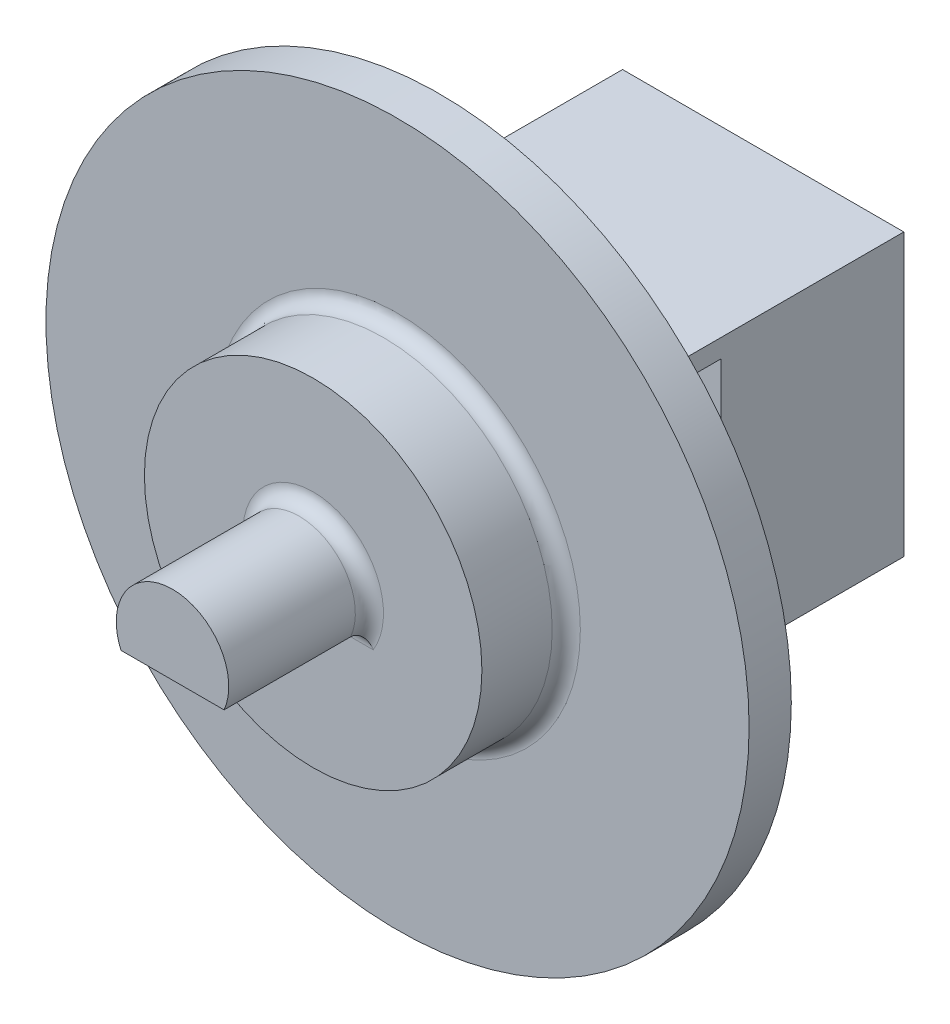
ISO-10303-21;
HEADER;
FILE_DESCRIPTION(('STEP AP214'),'2;1');
FILE_NAME('part.step','',(''),(''),'','','');
FILE_SCHEMA(('AUTOMOTIVE_DESIGN { 1 0 10303 214 1 1 1 1 }'));
ENDSEC;
DATA;
#1=APPLICATION_CONTEXT('core data for automotive mechanical design processes');
#2=APPLICATION_PROTOCOL_DEFINITION('international standard','automotive_design',2000,#1);
#3=PRODUCT_CONTEXT('',#1,'mechanical');
#4=PRODUCT('Part','Part','',(#3));
#5=PRODUCT_RELATED_PRODUCT_CATEGORY('part','',(#4));
#6=PRODUCT_DEFINITION_FORMATION('','',#4);
#7=PRODUCT_DEFINITION_CONTEXT('part definition',#1,'design');
#8=PRODUCT_DEFINITION('design','',#6,#7);
#9=PRODUCT_DEFINITION_SHAPE('','',#8);
#10=(LENGTH_UNIT() NAMED_UNIT(*) SI_UNIT(.MILLI.,.METRE.));
#11=(NAMED_UNIT(*) PLANE_ANGLE_UNIT() SI_UNIT($,.RADIAN.));
#12=(NAMED_UNIT(*) SI_UNIT($,.STERADIAN.) SOLID_ANGLE_UNIT());
#13=UNCERTAINTY_MEASURE_WITH_UNIT(LENGTH_MEASURE(1.E-05),#10,'distance_accuracy_value','');
#14=(GEOMETRIC_REPRESENTATION_CONTEXT(3) GLOBAL_UNCERTAINTY_ASSIGNED_CONTEXT((#13)) GLOBAL_UNIT_ASSIGNED_CONTEXT((#10,
#11,#12)) REPRESENTATION_CONTEXT('',''));
#15=CARTESIAN_POINT('',(0.,0.,0.));
#16=DIRECTION('',(0.,0.,1.));
#17=DIRECTION('',(1.,0.,0.));
#18=AXIS2_PLACEMENT_3D('',#15,#16,#17);
#19=CARTESIAN_POINT('',(5.,0.,11.5));
#20=DIRECTION('',(-1.,0.,0.));
#21=DIRECTION('',(0.,0.,1.));
#22=AXIS2_PLACEMENT_3D('',#19,#20,#21);
#23=PLANE('',#22);
#24=DIRECTION('',(0.,0.,-1.));
#25=VECTOR('',#24,1.);
#26=CARTESIAN_POINT('',(5.,-1.66255496103363,11.5));
#27=LINE('',#26,#25);
#28=CARTESIAN_POINT('',(5.,-1.66255496103363,11.5));
#29=VERTEX_POINT('',#28);
#30=CARTESIAN_POINT('',(5.,-1.66255496103363,6.5));
#31=VERTEX_POINT('',#30);
#32=EDGE_CURVE('E231',#29,#31,#27,.T.);
#33=ORIENTED_EDGE('',*,*,#32,.F.);
#34=DIRECTION('',(0.,1.,0.));
#35=VECTOR('',#34,1.);
#36=CARTESIAN_POINT('',(5.,0.,11.5));
#37=LINE('',#36,#35);
#38=CARTESIAN_POINT('',(5.,-5.,11.5));
#39=VERTEX_POINT('',#38);
#40=EDGE_CURVE('E283',#39,#29,#37,.T.);
#41=ORIENTED_EDGE('',*,*,#40,.F.);
#42=DIRECTION('',(0.,0.,-1.));
#43=VECTOR('',#42,1.);
#44=CARTESIAN_POINT('',(5.,-5.,11.5));
#45=LINE('',#44,#43);
#46=CARTESIAN_POINT('',(5.,-5.,0.));
#47=VERTEX_POINT('',#46);
#48=EDGE_CURVE('E311',#39,#47,#45,.T.);
#49=ORIENTED_EDGE('',*,*,#48,.T.);
#50=DIRECTION('',(0.,1.,0.));
#51=VECTOR('',#50,1.);
#52=CARTESIAN_POINT('',(5.,0.,0.));
#53=LINE('',#52,#51);
#54=CARTESIAN_POINT('',(5.,5.,0.));
#55=VERTEX_POINT('',#54);
#56=EDGE_CURVE('E295',#47,#55,#53,.T.);
#57=ORIENTED_EDGE('',*,*,#56,.T.);
#58=DIRECTION('',(0.,0.,-1.));
#59=VECTOR('',#58,1.);
#60=CARTESIAN_POINT('',(5.,5.,11.5));
#61=LINE('',#60,#59);
#62=CARTESIAN_POINT('',(5.,5.,11.5));
#63=VERTEX_POINT('',#62);
#64=EDGE_CURVE('E309',#63,#55,#61,.T.);
#65=ORIENTED_EDGE('',*,*,#64,.F.);
#66=CARTESIAN_POINT('',(5.,4.34204688534485,11.5));
#67=VERTEX_POINT('',#66);
#68=EDGE_CURVE('E281',#67,#63,#37,.T.);
#69=ORIENTED_EDGE('',*,*,#68,.F.);
#70=DIRECTION('',(0.,0.,1.));
#71=VECTOR('',#70,1.);
#72=CARTESIAN_POINT('',(5.,4.34204688534485,11.5));
#73=LINE('',#72,#71);
#74=CARTESIAN_POINT('',(5.,4.34204688534485,6.5));
#75=VERTEX_POINT('',#74);
#76=EDGE_CURVE('E229',#75,#67,#73,.T.);
#77=ORIENTED_EDGE('',*,*,#76,.F.);
#78=DIRECTION('',(0.,1.,0.));
#79=VECTOR('',#78,1.);
#80=CARTESIAN_POINT('',(5.,0.,6.5));
#81=LINE('',#80,#79);
#82=EDGE_CURVE('E234',#31,#75,#81,.T.);
#83=ORIENTED_EDGE('',*,*,#82,.F.);
#84=EDGE_LOOP('',(#33,#41,#49,#57,#65,#69,#77,#83));
#85=FACE_BOUND('',#84,.T.);
#86=ADVANCED_FACE('F62',(#85),#23,.F.);
#87=CARTESIAN_POINT('',(2.05060966544099,2.05060966544099,6.5));
#88=DIRECTION('',(-0.707106781186548,-0.707106781186548,0.));
#89=DIRECTION('',(0.707106781186548,-0.707106781186548,0.));
#90=AXIS2_PLACEMENT_3D('',#87,#88,#89);
#91=PLANE('',#90);
#92=DIRECTION('',(-0.707106781186547,0.707106781186548,0.));
#93=VECTOR('',#92,1.);
#94=CARTESIAN_POINT('',(3.23452970778619,0.866689623095786,13.));
#95=LINE('',#94,#93);
#96=CARTESIAN_POINT('',(3.23452970778619,0.866689623095786,13.));
#97=VERTEX_POINT('',#96);
#98=CARTESIAN_POINT('',(1.27493791355965,2.82628141732233,13.));
#99=VERTEX_POINT('',#98);
#100=EDGE_CURVE('E239',#97,#99,#95,.T.);
#101=ORIENTED_EDGE('',*,*,#100,.T.);
#102=CARTESIAN_POINT('',(1.27493791355965,2.82628141732233,12.5));
#103=DIRECTION('',(-0.707106781186548,-0.707106781186548,0.));
#104=DIRECTION('',(-0.707106781186548,0.707106781186548,0.));
#105=AXIS2_PLACEMENT_3D('',#102,#103,#104);
#106=ELLIPSE('',#105,0.577350269189626,0.5);
#107=CARTESIAN_POINT('',(0.866689623095786,3.23452970778619,12.5));
#108=VERTEX_POINT('',#107);
#109=EDGE_CURVE('E333',#99,#108,#106,.T.);
#110=ORIENTED_EDGE('',*,*,#109,.T.);
#111=DIRECTION('',(0.,0.,1.));
#112=VECTOR('',#111,1.);
#113=CARTESIAN_POINT('',(0.866689623095786,3.23452970778619,6.5));
#114=LINE('',#113,#112);
#115=CARTESIAN_POINT('',(0.866689623095788,3.23452970778619,11.5));
#116=VERTEX_POINT('',#115);
#117=EDGE_CURVE('E272',#116,#108,#114,.T.);
#118=ORIENTED_EDGE('',*,*,#117,.F.);
#119=DIRECTION('',(0.707106781186548,-0.707106781186548,0.));
#120=VECTOR('',#119,1.);
#121=CARTESIAN_POINT('',(2.05060966544099,2.05060966544099,11.5));
#122=LINE('',#121,#120);
#123=CARTESIAN_POINT('',(3.23452970778619,0.866689623095786,11.5));
#124=VERTEX_POINT('',#123);
#125=EDGE_CURVE('E226',#116,#124,#122,.T.);
#126=ORIENTED_EDGE('',*,*,#125,.T.);
#127=DIRECTION('',(0.,0.,1.));
#128=VECTOR('',#127,1.);
#129=CARTESIAN_POINT('',(3.23452970778619,0.866689623095786,6.5));
#130=LINE('',#129,#128);
#131=EDGE_CURVE('E269',#124,#97,#130,.T.);
#132=ORIENTED_EDGE('',*,*,#131,.T.);
#133=EDGE_LOOP('',(#101,#110,#118,#126,#132));
#134=FACE_BOUND('',#133,.T.);
#135=ADVANCED_FACE('F388',(#134),#91,.T.);
#136=CARTESIAN_POINT('',(2.8011848962383,-0.75057523079731,6.5));
#137=DIRECTION('',(-0.965925826289068,0.258819045102521,0.));
#138=DIRECTION('',(-0.258819045102521,-0.965925826289068,0.));
#139=AXIS2_PLACEMENT_3D('',#136,#137,#138);
#140=PLANE('',#139);
#141=DIRECTION('',(0.,0.,1.));
#142=VECTOR('',#141,1.);
#143=CARTESIAN_POINT('',(2.36784008469041,-2.3678400846904,6.5));
#144=LINE('',#143,#142);
#145=CARTESIAN_POINT('',(2.36784008469041,-2.36784008469041,11.5));
#146=VERTEX_POINT('',#145);
#147=CARTESIAN_POINT('',(2.36784008469041,-2.3678400846904,12.5));
#148=VERTEX_POINT('',#147);
#149=EDGE_CURVE('E266',#146,#148,#144,.T.);
#150=ORIENTED_EDGE('',*,*,#149,.T.);
#151=CARTESIAN_POINT('',(2.51726933005175,-1.8101625488652,12.5));
#152=DIRECTION('',(-0.965925826289068,0.258819045102521,0.));
#153=DIRECTION('',(0.258819045102521,0.965925826289068,0.));
#154=AXIS2_PLACEMENT_3D('',#151,#152,#153);
#155=ELLIPSE('',#154,0.577350269189626,0.5);
#156=CARTESIAN_POINT('',(2.51726933005175,-1.8101625488652,13.));
#157=VERTEX_POINT('',#156);
#158=EDGE_CURVE('E317',#148,#157,#155,.T.);
#159=ORIENTED_EDGE('',*,*,#158,.T.);
#160=DIRECTION('',(0.258819045102521,0.965925826289068,0.));
#161=VECTOR('',#160,1.);
#162=CARTESIAN_POINT('',(2.3678400846904,-2.36784008469041,13.));
#163=LINE('',#162,#161);
#164=EDGE_CURVE('E237',#157,#97,#163,.T.);
#165=ORIENTED_EDGE('',*,*,#164,.T.);
#166=ORIENTED_EDGE('',*,*,#131,.F.);
#167=DIRECTION('',(-0.258819045102521,-0.965925826289068,0.));
#168=VECTOR('',#167,1.);
#169=CARTESIAN_POINT('',(2.8011848962383,-0.75057523079731,11.5));
#170=LINE('',#169,#168);
#171=EDGE_CURVE('E223',#124,#146,#170,.T.);
#172=ORIENTED_EDGE('',*,*,#171,.T.);
#173=EDGE_LOOP('',(#150,#159,#165,#166,#172));
#174=FACE_BOUND('',#173,.T.);
#175=ADVANCED_FACE('F384',(#174),#140,.T.);
#176=CARTESIAN_POINT('',(0.,-5.,11.5));
#177=DIRECTION('',(0.,1.,0.));
#178=DIRECTION('',(0.,0.,1.));
#179=AXIS2_PLACEMENT_3D('',#176,#177,#178);
#180=PLANE('',#179);
#181=DIRECTION('',(1.,0.,0.));
#182=VECTOR('',#181,1.);
#183=CARTESIAN_POINT('',(0.,-5.,0.));
#184=LINE('',#183,#182);
#185=CARTESIAN_POINT('',(-5.,-5.,0.));
#186=VERTEX_POINT('',#185);
#187=EDGE_CURVE('E278',#186,#47,#184,.T.);
#188=ORIENTED_EDGE('',*,*,#187,.T.);
#189=ORIENTED_EDGE('',*,*,#48,.F.);
#190=DIRECTION('',(1.,0.,0.));
#191=VECTOR('',#190,1.);
#192=CARTESIAN_POINT('',(0.,-5.,11.5));
#193=LINE('',#192,#191);
#194=CARTESIAN_POINT('',(-5.,-5.,11.5));
#195=VERTEX_POINT('',#194);
#196=EDGE_CURVE('E279',#195,#39,#193,.T.);
#197=ORIENTED_EDGE('',*,*,#196,.F.);
#198=DIRECTION('',(0.,0.,-1.));
#199=VECTOR('',#198,1.);
#200=CARTESIAN_POINT('',(-5.,-5.,11.5));
#201=LINE('',#200,#199);
#202=EDGE_CURVE('E292',#195,#186,#201,.T.);
#203=ORIENTED_EDGE('',*,*,#202,.T.);
#204=EDGE_LOOP('',(#188,#189,#197,#203));
#205=FACE_BOUND('',#204,.T.);
#206=ADVANCED_FACE('F380',(#205),#180,.F.);
#207=CARTESIAN_POINT('',(0.,5.,11.5));
#208=DIRECTION('',(0.,1.,0.));
#209=DIRECTION('',(0.,0.,1.));
#210=AXIS2_PLACEMENT_3D('',#207,#208,#209);
#211=PLANE('',#210);
#212=DIRECTION('',(1.,0.,0.));
#213=VECTOR('',#212,1.);
#214=CARTESIAN_POINT('',(0.,5.,0.));
#215=LINE('',#214,#213);
#216=CARTESIAN_POINT('',(-5.,5.,0.));
#217=VERTEX_POINT('',#216);
#218=EDGE_CURVE('E298',#217,#55,#215,.T.);
#219=ORIENTED_EDGE('',*,*,#218,.F.);
#220=DIRECTION('',(0.,0.,-1.));
#221=VECTOR('',#220,1.);
#222=CARTESIAN_POINT('',(-5.,5.,11.5));
#223=LINE('',#222,#221);
#224=CARTESIAN_POINT('',(-5.,5.,11.5));
#225=VERTEX_POINT('',#224);
#226=EDGE_CURVE('E307',#225,#217,#223,.T.);
#227=ORIENTED_EDGE('',*,*,#226,.F.);
#228=DIRECTION('',(1.,0.,0.));
#229=VECTOR('',#228,1.);
#230=CARTESIAN_POINT('',(0.,5.,11.5));
#231=LINE('',#230,#229);
#232=EDGE_CURVE('E286',#225,#63,#231,.T.);
#233=ORIENTED_EDGE('',*,*,#232,.T.);
#234=ORIENTED_EDGE('',*,*,#64,.T.);
#235=EDGE_LOOP('',(#219,#227,#233,#234));
#236=FACE_BOUND('',#235,.T.);
#237=ADVANCED_FACE('F383',(#236),#211,.T.);
#238=CARTESIAN_POINT('',(-5.,0.,11.5));
#239=DIRECTION('',(-1.,0.,0.));
#240=DIRECTION('',(0.,0.,1.));
#241=AXIS2_PLACEMENT_3D('',#238,#239,#240);
#242=PLANE('',#241);
#243=DIRECTION('',(0.,1.,0.));
#244=VECTOR('',#243,1.);
#245=CARTESIAN_POINT('',(-5.,0.,0.));
#246=LINE('',#245,#244);
#247=EDGE_CURVE('E301',#186,#217,#246,.T.);
#248=ORIENTED_EDGE('',*,*,#247,.F.);
#249=ORIENTED_EDGE('',*,*,#202,.F.);
#250=DIRECTION('',(0.,1.,0.));
#251=VECTOR('',#250,1.);
#252=CARTESIAN_POINT('',(-5.,0.,11.5));
#253=LINE('',#252,#251);
#254=EDGE_CURVE('E289',#195,#225,#253,.T.);
#255=ORIENTED_EDGE('',*,*,#254,.T.);
#256=ORIENTED_EDGE('',*,*,#226,.T.);
#257=EDGE_LOOP('',(#248,#249,#255,#256));
#258=FACE_BOUND('',#257,.T.);
#259=ADVANCED_FACE('F392',(#258),#242,.T.);
#260=CARTESIAN_POINT('',(0.,0.,11.5));
#261=DIRECTION('',(0.,0.,-1.));
#262=DIRECTION('',(-1.,0.,0.));
#263=AXIS2_PLACEMENT_3D('',#260,#261,#262);
#264=CYLINDRICAL_SURFACE('',#263,1.75);
#265=CARTESIAN_POINT('',(0.,0.,6.5));
#266=DIRECTION('',(0.,0.,1.));
#267=DIRECTION('',(1.,0.,0.));
#268=AXIS2_PLACEMENT_3D('',#265,#266,#267);
#269=CIRCLE('',#268,1.75);
#270=CARTESIAN_POINT('',(1.75,0.,6.5));
#271=VERTEX_POINT('',#270);
#272=EDGE_CURVE('E246',#271,#271,#269,.T.);
#273=ORIENTED_EDGE('',*,*,#272,.T.);
#274=EDGE_LOOP('',(#273));
#275=FACE_BOUND('',#274,.T.);
#276=CARTESIAN_POINT('',(0.,0.,0.));
#277=DIRECTION('',(0.,0.,1.));
#278=DIRECTION('',(1.,0.,0.));
#279=AXIS2_PLACEMENT_3D('',#276,#277,#278);
#280=CIRCLE('',#279,1.75);
#281=CARTESIAN_POINT('',(1.75,0.,0.));
#282=VERTEX_POINT('',#281);
#283=EDGE_CURVE('E282',#282,#282,#280,.T.);
#284=ORIENTED_EDGE('',*,*,#283,.F.);
#285=EDGE_LOOP('',(#284));
#286=FACE_BOUND('',#285,.T.);
#287=ADVANCED_FACE('F396',(#275,#286),#264,.F.);
#288=CARTESIAN_POINT('',(0.,0.,0.));
#289=DIRECTION('',(0.,0.,1.));
#290=DIRECTION('',(1.,0.,0.));
#291=AXIS2_PLACEMENT_3D('',#288,#289,#290);
#292=PLANE('',#291);
#293=ORIENTED_EDGE('',*,*,#187,.F.);
#294=ORIENTED_EDGE('',*,*,#247,.T.);
#295=ORIENTED_EDGE('',*,*,#218,.T.);
#296=ORIENTED_EDGE('',*,*,#56,.F.);
#297=EDGE_LOOP('',(#293,#294,#295,#296));
#298=FACE_BOUND('',#297,.T.);
#299=ORIENTED_EDGE('',*,*,#283,.T.);
#300=EDGE_LOOP('',(#299));
#301=FACE_BOUND('',#300,.T.);
#302=ADVANCED_FACE('F400',(#298,#301),#292,.F.);
#303=CARTESIAN_POINT('',(-2.8011848962383,0.750575230797311,6.5));
#304=DIRECTION('',(0.965925826289068,-0.258819045102521,0.));
#305=DIRECTION('',(0.258819045102521,0.965925826289068,0.));
#306=AXIS2_PLACEMENT_3D('',#303,#304,#305);
#307=PLANE('',#306);
#308=DIRECTION('',(0.,0.,1.));
#309=VECTOR('',#308,1.);
#310=CARTESIAN_POINT('',(-2.3678400846904,2.36784008469041,6.5));
#311=LINE('',#310,#309);
#312=CARTESIAN_POINT('',(-2.3678400846904,2.36784008469041,6.5));
#313=VERTEX_POINT('',#312);
#314=CARTESIAN_POINT('',(-2.3678400846904,2.36784008469041,12.5));
#315=VERTEX_POINT('',#314);
#316=EDGE_CURVE('E275',#313,#315,#311,.T.);
#317=ORIENTED_EDGE('',*,*,#316,.T.);
#318=DIRECTION('',(-0.258819045102521,-0.965925826289068,0.));
#319=VECTOR('',#318,1.);
#320=CARTESIAN_POINT('',(-2.8011848962383,0.750575230797311,12.5));
#321=LINE('',#320,#319);
#322=CARTESIAN_POINT('',(-3.23452970778619,-0.866689623095785,12.5));
#323=VERTEX_POINT('',#322);
#324=EDGE_CURVE('E329',#315,#323,#321,.T.);
#325=ORIENTED_EDGE('',*,*,#324,.T.);
#326=DIRECTION('',(0.,0.,1.));
#327=VECTOR('',#326,1.);
#328=CARTESIAN_POINT('',(-3.23452970778619,-0.866689623095785,6.5));
#329=LINE('',#328,#327);
#330=CARTESIAN_POINT('',(-3.23452970778619,-0.866689623095785,6.5));
#331=VERTEX_POINT('',#330);
#332=EDGE_CURVE('E260',#331,#323,#329,.T.);
#333=ORIENTED_EDGE('',*,*,#332,.F.);
#334=DIRECTION('',(0.258819045102521,0.965925826289068,0.));
#335=VECTOR('',#334,1.);
#336=CARTESIAN_POINT('',(-2.8011848962383,0.750575230797311,6.5));
#337=LINE('',#336,#335);
#338=EDGE_CURVE('E251',#331,#313,#337,.T.);
#339=ORIENTED_EDGE('',*,*,#338,.T.);
#340=EDGE_LOOP('',(#317,#325,#333,#339));
#341=FACE_BOUND('',#340,.T.);
#342=ADVANCED_FACE('F404',(#341),#307,.T.);
#343=CARTESIAN_POINT('',(-0.75057523079731,2.8011848962383,6.5));
#344=DIRECTION('',(0.258819045102521,-0.965925826289068,0.));
#345=DIRECTION('',(0.965925826289068,0.258819045102521,0.));
#346=AXIS2_PLACEMENT_3D('',#343,#344,#345);
#347=PLANE('',#346);
#348=ORIENTED_EDGE('',*,*,#117,.T.);
#349=DIRECTION('',(-0.965925826289068,-0.258819045102521,0.));
#350=VECTOR('',#349,1.);
#351=CARTESIAN_POINT('',(-0.75057523079731,2.8011848962383,12.5));
#352=LINE('',#351,#350);
#353=EDGE_CURVE('E331',#108,#315,#352,.T.);
#354=ORIENTED_EDGE('',*,*,#353,.T.);
#355=ORIENTED_EDGE('',*,*,#316,.F.);
#356=DIRECTION('',(0.965925826289068,0.258819045102521,0.));
#357=VECTOR('',#356,1.);
#358=CARTESIAN_POINT('',(-0.75057523079731,2.8011848962383,6.5));
#359=LINE('',#358,#357);
#360=EDGE_CURVE('E254',#313,#75,#359,.T.);
#361=ORIENTED_EDGE('',*,*,#360,.T.);
#362=ORIENTED_EDGE('',*,*,#76,.T.);
#363=DIRECTION('',(-0.965925826289069,-0.25881904510252,0.));
#364=VECTOR('',#363,1.);
#365=CARTESIAN_POINT('',(14.0370835428554,6.76352612258555,11.5));
#366=LINE('',#365,#364);
#367=EDGE_CURVE('E217',#67,#116,#366,.T.);
#368=ORIENTED_EDGE('',*,*,#367,.T.);
#369=EDGE_LOOP('',(#348,#354,#355,#361,#362,#368));
#370=FACE_BOUND('',#369,.T.);
#371=ADVANCED_FACE('F408',(#370),#347,.T.);
#372=CARTESIAN_POINT('',(0.75057523079731,-2.8011848962383,6.5));
#373=DIRECTION('',(-0.258819045102521,0.965925826289068,0.));
#374=DIRECTION('',(-0.965925826289068,-0.258819045102521,0.));
#375=AXIS2_PLACEMENT_3D('',#372,#373,#374);
#376=PLANE('',#375);
#377=DIRECTION('',(0.,0.,1.));
#378=VECTOR('',#377,1.);
#379=CARTESIAN_POINT('',(-0.866689623095786,-3.23452970778619,6.5));
#380=LINE('',#379,#378);
#381=CARTESIAN_POINT('',(-0.866689623095786,-3.23452970778619,6.5));
#382=VERTEX_POINT('',#381);
#383=CARTESIAN_POINT('',(-0.866689623095786,-3.23452970778619,12.5));
#384=VERTEX_POINT('',#383);
#385=EDGE_CURVE('E263',#382,#384,#380,.T.);
#386=ORIENTED_EDGE('',*,*,#385,.T.);
#387=DIRECTION('',(0.965925826289068,0.258819045102521,0.));
#388=VECTOR('',#387,1.);
#389=CARTESIAN_POINT('',(0.75057523079731,-2.8011848962383,12.5));
#390=LINE('',#389,#388);
#391=EDGE_CURVE('E314',#384,#148,#390,.T.);
#392=ORIENTED_EDGE('',*,*,#391,.T.);
#393=ORIENTED_EDGE('',*,*,#149,.F.);
#394=DIRECTION('',(-0.965925826289069,-0.25881904510252,0.));
#395=VECTOR('',#394,1.);
#396=CARTESIAN_POINT('',(15.5382340044501,1.16115633010895,11.5));
#397=LINE('',#396,#395);
#398=EDGE_CURVE('E221',#29,#146,#397,.T.);
#399=ORIENTED_EDGE('',*,*,#398,.F.);
#400=ORIENTED_EDGE('',*,*,#32,.T.);
#401=DIRECTION('',(-0.965925826289068,-0.258819045102521,0.));
#402=VECTOR('',#401,1.);
#403=CARTESIAN_POINT('',(0.75057523079731,-2.8011848962383,6.5));
#404=LINE('',#403,#402);
#405=EDGE_CURVE('E256',#31,#382,#404,.T.);
#406=ORIENTED_EDGE('',*,*,#405,.T.);
#407=EDGE_LOOP('',(#386,#392,#393,#399,#400,#406));
#408=FACE_BOUND('',#407,.T.);
#409=ADVANCED_FACE('F412',(#408),#376,.T.);
#410=CARTESIAN_POINT('',(-2.05060966544099,-2.05060966544099,6.5));
#411=DIRECTION('',(0.707106781186548,0.707106781186548,0.));
#412=DIRECTION('',(-0.707106781186548,0.707106781186548,0.));
#413=AXIS2_PLACEMENT_3D('',#410,#411,#412);
#414=PLANE('',#413);
#415=ORIENTED_EDGE('',*,*,#332,.T.);
#416=DIRECTION('',(0.707106781186548,-0.707106781186548,0.));
#417=VECTOR('',#416,1.);
#418=CARTESIAN_POINT('',(-2.05060966544099,-2.05060966544099,12.5));
#419=LINE('',#418,#417);
#420=EDGE_CURVE('E327',#323,#384,#419,.T.);
#421=ORIENTED_EDGE('',*,*,#420,.T.);
#422=ORIENTED_EDGE('',*,*,#385,.F.);
#423=DIRECTION('',(-0.707106781186548,0.707106781186548,0.));
#424=VECTOR('',#423,1.);
#425=CARTESIAN_POINT('',(-2.05060966544099,-2.05060966544099,6.5));
#426=LINE('',#425,#424);
#427=EDGE_CURVE('E258',#382,#331,#426,.T.);
#428=ORIENTED_EDGE('',*,*,#427,.T.);
#429=EDGE_LOOP('',(#415,#421,#422,#428));
#430=FACE_BOUND('',#429,.T.);
#431=ADVANCED_FACE('F422',(#430),#414,.T.);
#432=CARTESIAN_POINT('',(0.,0.,6.5));
#433=DIRECTION('',(0.,0.,-1.));
#434=DIRECTION('',(-1.,0.,0.));
#435=AXIS2_PLACEMENT_3D('',#432,#433,#434);
#436=PLANE('',#435);
#437=ORIENTED_EDGE('',*,*,#272,.F.);
#438=EDGE_LOOP('',(#437));
#439=FACE_BOUND('',#438,.T.);
#440=ORIENTED_EDGE('',*,*,#405,.F.);
#441=ORIENTED_EDGE('',*,*,#82,.T.);
#442=ORIENTED_EDGE('',*,*,#360,.F.);
#443=ORIENTED_EDGE('',*,*,#338,.F.);
#444=ORIENTED_EDGE('',*,*,#427,.F.);
#445=EDGE_LOOP('',(#440,#441,#442,#443,#444));
#446=FACE_BOUND('',#445,.T.);
#447=ADVANCED_FACE('F426',(#439,#446),#436,.F.);
#448=CARTESIAN_POINT('',(0.,0.,11.5));
#449=DIRECTION('',(0.,0.,1.));
#450=DIRECTION('',(1.,0.,0.));
#451=AXIS2_PLACEMENT_3D('',#448,#449,#450);
#452=PLANE('',#451);
#453=ORIENTED_EDGE('',*,*,#40,.T.);
#454=ORIENTED_EDGE('',*,*,#398,.T.);
#455=ORIENTED_EDGE('',*,*,#171,.F.);
#456=ORIENTED_EDGE('',*,*,#125,.F.);
#457=ORIENTED_EDGE('',*,*,#367,.F.);
#458=ORIENTED_EDGE('',*,*,#68,.T.);
#459=ORIENTED_EDGE('',*,*,#232,.F.);
#460=ORIENTED_EDGE('',*,*,#254,.F.);
#461=ORIENTED_EDGE('',*,*,#196,.T.);
#462=EDGE_LOOP('',(#453,#454,#455,#456,#457,#458,#459,#460,#461));
#463=FACE_BOUND('',#462,.T.);
#464=CARTESIAN_POINT('',(0.,0.,11.5));
#465=DIRECTION('',(0.,0.,1.));
#466=DIRECTION('',(1.,0.,0.));
#467=AXIS2_PLACEMENT_3D('',#464,#465,#466);
#468=CIRCLE('',#467,12.5);
#469=CARTESIAN_POINT('',(12.5,0.,11.5));
#470=VERTEX_POINT('',#469);
#471=EDGE_CURVE('E242',#470,#470,#468,.T.);
#472=ORIENTED_EDGE('',*,*,#471,.F.);
#473=EDGE_LOOP('',(#472));
#474=FACE_BOUND('',#473,.T.);
#475=ADVANCED_FACE('F430',(#463,#474),#452,.F.);
#476=CARTESIAN_POINT('',(0.,0.,13.));
#477=DIRECTION('',(0.,0.,1.));
#478=DIRECTION('',(1.,0.,0.));
#479=AXIS2_PLACEMENT_3D('',#476,#477,#478);
#480=PLANE('',#479);
#481=CARTESIAN_POINT('',(0.,0.,13.));
#482=DIRECTION('',(0.,0.,1.));
#483=DIRECTION('',(1.,0.,0.));
#484=AXIS2_PLACEMENT_3D('',#481,#482,#483);
#485=CIRCLE('',#484,6.5);
#486=CARTESIAN_POINT('',(6.5,0.,13.));
#487=VERTEX_POINT('',#486);
#488=EDGE_CURVE('E342',#487,#487,#485,.F.);
#489=ORIENTED_EDGE('',*,*,#488,.T.);
#490=EDGE_LOOP('',(#489));
#491=FACE_BOUND('',#490,.T.);
#492=CARTESIAN_POINT('',(0.,0.,13.));
#493=DIRECTION('',(0.,0.,1.));
#494=DIRECTION('',(1.,0.,0.));
#495=AXIS2_PLACEMENT_3D('',#492,#493,#494);
#496=CIRCLE('',#495,12.5);
#497=CARTESIAN_POINT('',(12.5,0.,13.));
#498=VERTEX_POINT('',#497);
#499=EDGE_CURVE('E243',#498,#498,#496,.T.);
#500=ORIENTED_EDGE('',*,*,#499,.T.);
#501=EDGE_LOOP('',(#500));
#502=FACE_BOUND('',#501,.T.);
#503=ADVANCED_FACE('F436',(#491,#502),#480,.T.);
#504=CARTESIAN_POINT('',(0.,0.,13.));
#505=DIRECTION('',(0.,0.,-1.));
#506=DIRECTION('',(-1.,0.,0.));
#507=AXIS2_PLACEMENT_3D('',#504,#505,#506);
#508=CYLINDRICAL_SURFACE('',#507,12.5);
#509=ORIENTED_EDGE('',*,*,#499,.F.);
#510=EDGE_LOOP('',(#509));
#511=FACE_BOUND('',#510,.T.);
#512=ORIENTED_EDGE('',*,*,#471,.T.);
#513=EDGE_LOOP('',(#512));
#514=FACE_BOUND('',#513,.T.);
#515=ADVANCED_FACE('F432',(#511,#514),#508,.T.);
#516=CARTESIAN_POINT('',(0.,0.,16.));
#517=DIRECTION('',(0.,0.,1.));
#518=DIRECTION('',(1.,0.,0.));
#519=AXIS2_PLACEMENT_3D('',#516,#517,#518);
#520=PLANE('',#519);
#521=CARTESIAN_POINT('',(0.,0.,16.));
#522=DIRECTION('',(0.,0.,1.));
#523=DIRECTION('',(1.,0.,0.));
#524=AXIS2_PLACEMENT_3D('',#521,#522,#523);
#525=CIRCLE('',#524,2.5);
#526=CARTESIAN_POINT('',(-2.13541565040626,-1.3,16.));
#527=VERTEX_POINT('',#526);
#528=CARTESIAN_POINT('',(2.13541565040626,-1.3,16.));
#529=VERTEX_POINT('',#528);
#530=EDGE_CURVE('E83',#527,#529,#525,.F.);
#531=ORIENTED_EDGE('',*,*,#530,.T.);
#532=DIRECTION('',(1.,0.,0.));
#533=VECTOR('',#532,1.);
#534=CARTESIAN_POINT('',(0.,-1.3,16.));
#535=LINE('',#534,#533);
#536=EDGE_CURVE('E76',#529,#527,#535,.F.);
#537=ORIENTED_EDGE('',*,*,#536,.T.);
#538=EDGE_LOOP('',(#531,#537));
#539=FACE_BOUND('',#538,.T.);
#540=CARTESIAN_POINT('',(0.,0.,16.));
#541=DIRECTION('',(0.,0.,1.));
#542=DIRECTION('',(1.,0.,0.));
#543=AXIS2_PLACEMENT_3D('',#540,#541,#542);
#544=CIRCLE('',#543,6.);
#545=CARTESIAN_POINT('',(6.,0.,16.));
#546=VERTEX_POINT('',#545);
#547=EDGE_CURVE('E214',#546,#546,#544,.T.);
#548=ORIENTED_EDGE('',*,*,#547,.T.);
#549=EDGE_LOOP('',(#548));
#550=FACE_BOUND('',#549,.T.);
#551=ADVANCED_FACE('F435',(#539,#550),#520,.T.);
#552=CARTESIAN_POINT('',(0.,0.,16.));
#553=DIRECTION('',(0.,0.,-1.));
#554=DIRECTION('',(-1.,0.,0.));
#555=AXIS2_PLACEMENT_3D('',#552,#553,#554);
#556=CYLINDRICAL_SURFACE('',#555,6.);
#557=CARTESIAN_POINT('',(0.,0.,13.5));
#558=DIRECTION('',(0.,0.,1.));
#559=DIRECTION('',(1.,0.,0.));
#560=AXIS2_PLACEMENT_3D('',#557,#558,#559);
#561=CIRCLE('',#560,6.);
#562=CARTESIAN_POINT('',(6.,0.,13.5));
#563=VERTEX_POINT('',#562);
#564=EDGE_CURVE('E334',#563,#563,#561,.T.);
#565=ORIENTED_EDGE('',*,*,#564,.T.);
#566=EDGE_LOOP('',(#565));
#567=FACE_BOUND('',#566,.T.);
#568=ORIENTED_EDGE('',*,*,#547,.F.);
#569=EDGE_LOOP('',(#568));
#570=FACE_BOUND('',#569,.T.);
#571=ADVANCED_FACE('F444',(#567,#570),#556,.T.);
#572=CARTESIAN_POINT('',(0.,0.,13.));
#573=DIRECTION('',(0.,0.,1.));
#574=DIRECTION('',(1.,0.,0.));
#575=AXIS2_PLACEMENT_3D('',#572,#573,#574);
#576=PLANE('',#575);
#577=ORIENTED_EDGE('',*,*,#164,.F.);
#578=DIRECTION('',(0.965925826289068,0.258819045102521,0.));
#579=VECTOR('',#578,1.);
#580=CARTESIAN_POINT('',(0.621165708246049,-2.31822198309376,13.));
#581=LINE('',#580,#579);
#582=CARTESIAN_POINT('',(-0.717260377734444,-2.67685217196098,13.));
#583=VERTEX_POINT('',#582);
#584=EDGE_CURVE('E325',#157,#583,#581,.F.);
#585=ORIENTED_EDGE('',*,*,#584,.T.);
#586=DIRECTION('',(0.707106781186548,-0.707106781186548,0.));
#587=VECTOR('',#586,1.);
#588=CARTESIAN_POINT('',(-1.69705627484771,-1.69705627484771,13.));
#589=LINE('',#588,#587);
#590=CARTESIAN_POINT('',(-2.67685217196098,-0.717260377734443,13.));
#591=VERTEX_POINT('',#590);
#592=EDGE_CURVE('E323',#583,#591,#589,.F.);
#593=ORIENTED_EDGE('',*,*,#592,.T.);
#594=DIRECTION('',(-0.258819045102521,-0.965925826289068,0.));
#595=VECTOR('',#594,1.);
#596=CARTESIAN_POINT('',(-2.31822198309376,0.621165708246051,13.));
#597=LINE('',#596,#595);
#598=CARTESIAN_POINT('',(-1.95959179422654,1.95959179422654,13.));
#599=VERTEX_POINT('',#598);
#600=EDGE_CURVE('E321',#591,#599,#597,.F.);
#601=ORIENTED_EDGE('',*,*,#600,.T.);
#602=DIRECTION('',(-0.965925826289068,-0.258819045102521,0.));
#603=VECTOR('',#602,1.);
#604=CARTESIAN_POINT('',(-0.621165708246051,2.31822198309376,13.));
#605=LINE('',#604,#603);
#606=EDGE_CURVE('E319',#599,#99,#605,.F.);
#607=ORIENTED_EDGE('',*,*,#606,.T.);
#608=ORIENTED_EDGE('',*,*,#100,.F.);
#609=EDGE_LOOP('',(#577,#585,#593,#601,#607,#608));
#610=FACE_BOUND('',#609,.T.);
#611=ADVANCED_FACE('F368',(#610),#576,.F.);
#612=CARTESIAN_POINT('',(-0.62116570824605,2.31822198309376,12.5));
#613=DIRECTION('',(-0.965925826289068,-0.258819045102521,0.));
#614=DIRECTION('',(0.258819045102521,-0.965925826289068,0.));
#615=AXIS2_PLACEMENT_3D('',#612,#613,#614);
#616=CYLINDRICAL_SURFACE('',#615,0.5);
#617=ORIENTED_EDGE('',*,*,#109,.F.);
#618=ORIENTED_EDGE('',*,*,#606,.F.);
#619=CARTESIAN_POINT('',(-1.95959179422654,1.95959179422654,12.5));
#620=DIRECTION('',(-0.707106781186548,-0.707106781186547,0.));
#621=DIRECTION('',(0.707106781186547,-0.707106781186548,0.));
#622=AXIS2_PLACEMENT_3D('',#619,#620,#621);
#623=ELLIPSE('',#622,0.577350269189626,0.5);
#624=EDGE_CURVE('E218',#315,#599,#623,.F.);
#625=ORIENTED_EDGE('',*,*,#624,.F.);
#626=ORIENTED_EDGE('',*,*,#353,.F.);
#627=EDGE_LOOP('',(#617,#618,#625,#626));
#628=FACE_BOUND('',#627,.T.);
#629=ADVANCED_FACE('F364',(#628),#616,.F.);
#630=CARTESIAN_POINT('',(-2.31822198309376,0.62116570824605,12.5));
#631=DIRECTION('',(-0.258819045102521,-0.965925826289068,0.));
#632=DIRECTION('',(0.965925826289068,-0.258819045102521,0.));
#633=AXIS2_PLACEMENT_3D('',#630,#631,#632);
#634=CYLINDRICAL_SURFACE('',#633,0.5);
#635=ORIENTED_EDGE('',*,*,#624,.T.);
#636=ORIENTED_EDGE('',*,*,#600,.F.);
#637=CARTESIAN_POINT('',(-2.67685217196098,-0.717260377734443,12.5));
#638=DIRECTION('',(0.258819045102521,-0.965925826289068,0.));
#639=DIRECTION('',(0.965925826289068,0.258819045102521,0.));
#640=AXIS2_PLACEMENT_3D('',#637,#638,#639);
#641=ELLIPSE('',#640,0.577350269189626,0.5);
#642=EDGE_CURVE('E210',#323,#591,#641,.F.);
#643=ORIENTED_EDGE('',*,*,#642,.F.);
#644=ORIENTED_EDGE('',*,*,#324,.F.);
#645=EDGE_LOOP('',(#635,#636,#643,#644));
#646=FACE_BOUND('',#645,.T.);
#647=ADVANCED_FACE('F367',(#646),#634,.F.);
#648=CARTESIAN_POINT('',(-1.69705627484771,-1.69705627484771,12.5));
#649=DIRECTION('',(0.707106781186548,-0.707106781186548,0.));
#650=DIRECTION('',(0.707106781186548,0.707106781186548,0.));
#651=AXIS2_PLACEMENT_3D('',#648,#649,#650);
#652=CYLINDRICAL_SURFACE('',#651,0.5);
#653=ORIENTED_EDGE('',*,*,#642,.T.);
#654=ORIENTED_EDGE('',*,*,#592,.F.);
#655=CARTESIAN_POINT('',(-0.717260377734444,-2.67685217196098,12.5));
#656=DIRECTION('',(0.965925826289068,-0.258819045102521,0.));
#657=DIRECTION('',(0.258819045102521,0.965925826289068,0.));
#658=AXIS2_PLACEMENT_3D('',#655,#656,#657);
#659=ELLIPSE('',#658,0.577350269189626,0.5);
#660=EDGE_CURVE('E207',#384,#583,#659,.F.);
#661=ORIENTED_EDGE('',*,*,#660,.F.);
#662=ORIENTED_EDGE('',*,*,#420,.F.);
#663=EDGE_LOOP('',(#653,#654,#661,#662));
#664=FACE_BOUND('',#663,.T.);
#665=ADVANCED_FACE('F372',(#664),#652,.F.);
#666=CARTESIAN_POINT('',(0.62116570824605,-2.31822198309376,12.5));
#667=DIRECTION('',(0.965925826289068,0.258819045102521,0.));
#668=DIRECTION('',(-0.258819045102521,0.965925826289068,0.));
#669=AXIS2_PLACEMENT_3D('',#666,#667,#668);
#670=CYLINDRICAL_SURFACE('',#669,0.5);
#671=ORIENTED_EDGE('',*,*,#660,.T.);
#672=ORIENTED_EDGE('',*,*,#584,.F.);
#673=ORIENTED_EDGE('',*,*,#158,.F.);
#674=ORIENTED_EDGE('',*,*,#391,.F.);
#675=EDGE_LOOP('',(#671,#672,#673,#674));
#676=FACE_BOUND('',#675,.T.);
#677=ADVANCED_FACE('F362',(#676),#670,.F.);
#678=CARTESIAN_POINT('',(0.,0.,13.5));
#679=DIRECTION('',(0.,0.,1.));
#680=DIRECTION('',(1.,0.,0.));
#681=AXIS2_PLACEMENT_3D('',#678,#679,#680);
#682=TOROIDAL_SURFACE('',#681,6.5,0.5);
#683=ORIENTED_EDGE('',*,*,#488,.F.);
#684=EDGE_LOOP('',(#683));
#685=FACE_BOUND('',#684,.T.);
#686=ORIENTED_EDGE('',*,*,#564,.F.);
#687=EDGE_LOOP('',(#686));
#688=FACE_BOUND('',#687,.T.);
#689=ADVANCED_FACE('F358',(#685,#688),#682,.F.);
#690=CARTESIAN_POINT('',(0.,0.,21.));
#691=DIRECTION('',(0.,0.,-1.));
#692=DIRECTION('',(-1.,0.,0.));
#693=AXIS2_PLACEMENT_3D('',#690,#691,#692);
#694=CYLINDRICAL_SURFACE('',#693,2.);
#695=DIRECTION('',(0.,0.,-1.));
#696=VECTOR('',#695,1.);
#697=CARTESIAN_POINT('',(1.83303027798234,-0.8,21.));
#698=LINE('',#697,#696);
#699=CARTESIAN_POINT('',(1.83303027798234,-0.8,21.));
#700=VERTEX_POINT('',#699);
#701=CARTESIAN_POINT('',(1.83303027798234,-0.8,16.5));
#702=VERTEX_POINT('',#701);
#703=EDGE_CURVE('E197',#700,#702,#698,.T.);
#704=ORIENTED_EDGE('',*,*,#703,.T.);
#705=CARTESIAN_POINT('',(0.,0.,16.5));
#706=DIRECTION('',(0.,0.,1.));
#707=DIRECTION('',(1.,0.,0.));
#708=AXIS2_PLACEMENT_3D('',#705,#706,#707);
#709=CIRCLE('',#708,2.);
#710=CARTESIAN_POINT('',(-1.83303027798234,-0.8,16.5));
#711=VERTEX_POINT('',#710);
#712=EDGE_CURVE('E12',#702,#711,#709,.T.);
#713=ORIENTED_EDGE('',*,*,#712,.T.);
#714=DIRECTION('',(0.,0.,-1.));
#715=VECTOR('',#714,1.);
#716=CARTESIAN_POINT('',(-1.83303027798234,-0.8,21.));
#717=LINE('',#716,#715);
#718=CARTESIAN_POINT('',(-1.83303027798234,-0.8,21.));
#719=VERTEX_POINT('',#718);
#720=EDGE_CURVE('E195',#719,#711,#717,.T.);
#721=ORIENTED_EDGE('',*,*,#720,.F.);
#722=CARTESIAN_POINT('',(0.,0.,21.));
#723=DIRECTION('',(0.,0.,1.));
#724=DIRECTION('',(-1.,0.,0.));
#725=AXIS2_PLACEMENT_3D('',#722,#723,#724);
#726=CIRCLE('',#725,2.);
#727=EDGE_CURVE('E200',#700,#719,#726,.T.);
#728=ORIENTED_EDGE('',*,*,#727,.F.);
#729=EDGE_LOOP('',(#704,#713,#721,#728));
#730=FACE_BOUND('',#729,.T.);
#731=ADVANCED_FACE('F205',(#730),#694,.T.);
#732=CARTESIAN_POINT('',(-1.83303027798234,-0.8,21.));
#733=DIRECTION('',(0.,1.,0.));
#734=DIRECTION('',(0.,0.,1.));
#735=AXIS2_PLACEMENT_3D('',#732,#733,#734);
#736=PLANE('',#735);
#737=ORIENTED_EDGE('',*,*,#720,.T.);
#738=DIRECTION('',(1.,0.,0.));
#739=VECTOR('',#738,1.);
#740=CARTESIAN_POINT('',(-1.83303027798234,-0.8,16.5));
#741=LINE('',#740,#739);
#742=EDGE_CURVE('E345',#711,#702,#741,.T.);
#743=ORIENTED_EDGE('',*,*,#742,.T.);
#744=ORIENTED_EDGE('',*,*,#703,.F.);
#745=DIRECTION('',(1.,0.,0.));
#746=VECTOR('',#745,1.);
#747=CARTESIAN_POINT('',(-1.83303027798234,-0.8,21.));
#748=LINE('',#747,#746);
#749=EDGE_CURVE('E190',#719,#700,#748,.T.);
#750=ORIENTED_EDGE('',*,*,#749,.F.);
#751=EDGE_LOOP('',(#737,#743,#744,#750));
#752=FACE_BOUND('',#751,.T.);
#753=ADVANCED_FACE('F192',(#752),#736,.F.);
#754=CARTESIAN_POINT('',(0.,0.,21.));
#755=DIRECTION('',(0.,0.,-1.));
#756=DIRECTION('',(-1.,0.,0.));
#757=AXIS2_PLACEMENT_3D('',#754,#755,#756);
#758=PLANE('',#757);
#759=ORIENTED_EDGE('',*,*,#727,.T.);
#760=ORIENTED_EDGE('',*,*,#749,.T.);
#761=EDGE_LOOP('',(#759,#760));
#762=FACE_BOUND('',#761,.T.);
#763=ADVANCED_FACE('F202',(#762),#758,.F.);
#764=CARTESIAN_POINT('',(0.,0.,16.5));
#765=DIRECTION('',(0.,0.,1.));
#766=DIRECTION('',(1.,0.,0.));
#767=AXIS2_PLACEMENT_3D('',#764,#765,#766);
#768=TOROIDAL_SURFACE('',#767,2.5,0.5);
#769=CARTESIAN_POINT('',(1.83303027798234,-0.8,16.5));
#770=CARTESIAN_POINT('',(1.83300346107756,-0.799965711208576,16.4750002588186));
#771=CARTESIAN_POINT('',(1.83425613557846,-0.801872412759745,16.4500377203468));
#772=CARTESIAN_POINT('',(1.83909947148262,-0.809282058033404,16.4010171918314));
#773=CARTESIAN_POINT('',(1.84267758570356,-0.814765702521142,16.3769550761043));
#774=CARTESIAN_POINT('',(1.85194865435738,-0.829039099487462,16.3303151240911));
#775=CARTESIAN_POINT('',(1.85763869990968,-0.837824304750002,16.3077352962775));
#776=CARTESIAN_POINT('',(1.87081573728103,-0.858294962727472,16.2644801526502));
#777=CARTESIAN_POINT('',(1.8783048306897,-0.869983807929294,16.243807103654));
#778=CARTESIAN_POINT('',(1.89529007710784,-0.896686665973463,16.2034141242617));
#779=CARTESIAN_POINT('',(1.90488663661572,-0.911870208980213,16.1838492017005));
#780=CARTESIAN_POINT('',(1.92535411412447,-0.94453483438918,16.1475204513979));
#781=CARTESIAN_POINT('',(1.93622532063305,-0.962016437050506,16.1307572598999));
#782=CARTESIAN_POINT('',(1.96066611720326,-1.00168354555954,16.0977921809365));
#783=CARTESIAN_POINT('',(1.97439290643634,-1.02417829961831,16.082078910061));
#784=CARTESIAN_POINT('',(2.00267446562738,-1.0710435505524,16.0546719825978));
#785=CARTESIAN_POINT('',(2.01723018026115,-1.09541619917957,16.0429830236067));
#786=CARTESIAN_POINT('',(2.04859520699128,-1.14852815253868,16.0225464738018));
#787=CARTESIAN_POINT('',(2.06546294625305,-1.17743759174595,16.014331102858));
#788=CARTESIAN_POINT('',(2.09929147616194,-1.23614144939258,16.0031989298318));
#789=CARTESIAN_POINT('',(2.11625195829584,-1.26593364811042,16.0002698226945));
#790=CARTESIAN_POINT('',(2.13383499704827,-1.29718797966194,16.0000059201558));
#791=CARTESIAN_POINT('',(2.13462552268838,-1.29859394924642,15.9999999882992));
#792=CARTESIAN_POINT('',(2.13541565040626,-1.3,16.));
#793=B_SPLINE_CURVE_WITH_KNOTS('',3,(#769,#770,#771,#772,#773,#774,#775,#776,#777,#778,#779,
#780,#781,#782,#783,#784,#785,#786,#787,#788,#789,#790,#791,#792),.UNSPECIFIED.,.F.,.F.,(4,2,2,
2,2,2,2,2,2,2,2,4),(0.,0.0748366668978519,0.149272859037978,0.22360690424723,0.298028210005831,
0.377402632795612,0.456795056255688,0.548477836817362,0.640267279079104,0.743245437766433,
0.845983579235076,0.85082248025872),.UNSPECIFIED.);
#794=EDGE_CURVE('E348',#529,#702,#793,.F.);
#795=ORIENTED_EDGE('',*,*,#794,.F.);
#796=ORIENTED_EDGE('',*,*,#530,.F.);
#797=CARTESIAN_POINT('',(-1.83303027798234,-0.8,16.5));
#798=CARTESIAN_POINT('',(-1.83300346107756,-0.799965711208576,16.4750002588186));
#799=CARTESIAN_POINT('',(-1.83425613557846,-0.801872412759745,16.4500377203468));
#800=CARTESIAN_POINT('',(-1.83909947148263,-0.809282058033404,16.4010171918314));
#801=CARTESIAN_POINT('',(-1.84267758570356,-0.814765702521142,16.3769550761043));
#802=CARTESIAN_POINT('',(-1.85194865435738,-0.829039099487462,16.3303151240911));
#803=CARTESIAN_POINT('',(-1.85763869990969,-0.837824304750002,16.3077352962775));
#804=CARTESIAN_POINT('',(-1.87081573728103,-0.858294962727472,16.2644801526502));
#805=CARTESIAN_POINT('',(-1.87830483068971,-0.869983807929294,16.243807103654));
#806=CARTESIAN_POINT('',(-1.89529007710785,-0.896686665973463,16.2034141242617));
#807=CARTESIAN_POINT('',(-1.90488663661572,-0.911870208980213,16.1838492017005));
#808=CARTESIAN_POINT('',(-1.92535411412447,-0.94453483438918,16.1475204513979));
#809=CARTESIAN_POINT('',(-1.93622532063305,-0.962016437050506,16.1307572598999));
#810=CARTESIAN_POINT('',(-1.96066611720327,-1.00168354555954,16.0977921809365));
#811=CARTESIAN_POINT('',(-1.97439290643634,-1.02417829961831,16.082078910061));
#812=CARTESIAN_POINT('',(-2.00267446562738,-1.0710435505524,16.0546719825978));
#813=CARTESIAN_POINT('',(-2.01723018026115,-1.09541619917957,16.0429830236067));
#814=CARTESIAN_POINT('',(-2.04859520699129,-1.14852815253868,16.0225464738018));
#815=CARTESIAN_POINT('',(-2.06546294625306,-1.17743759174595,16.014331102858));
#816=CARTESIAN_POINT('',(-2.09929147616194,-1.23614144939258,16.0031989298318));
#817=CARTESIAN_POINT('',(-2.11625195829584,-1.26593364811042,16.0002698226945));
#818=CARTESIAN_POINT('',(-2.13383499704827,-1.29718797966194,16.0000059201558));
#819=CARTESIAN_POINT('',(-2.13462552268838,-1.29859394924642,15.9999999882992));
#820=CARTESIAN_POINT('',(-2.13541565040626,-1.3,16.));
#821=B_SPLINE_CURVE_WITH_KNOTS('',3,(#797,#798,#799,#800,#801,#802,#803,#804,#805,#806,#807,
#808,#809,#810,#811,#812,#813,#814,#815,#816,#817,#818,#819,#820),.UNSPECIFIED.,.F.,.F.,(4,2,2,
2,2,2,2,2,2,2,2,4),(0.,0.074836666897852,0.149272859037978,0.22360690424723,0.298028210005831,
0.377402632795612,0.456795056255688,0.548477836817362,0.640267279079104,0.743245437766433,
0.845983579235076,0.850822480258721),.UNSPECIFIED.);
#822=EDGE_CURVE('E67',#711,#527,#821,.T.);
#823=ORIENTED_EDGE('',*,*,#822,.F.);
#824=ORIENTED_EDGE('',*,*,#712,.F.);
#825=EDGE_LOOP('',(#795,#796,#823,#824));
#826=FACE_BOUND('',#825,.T.);
#827=ADVANCED_FACE('F353',(#826),#768,.F.);
#828=CARTESIAN_POINT('',(-1.83303027798234,-1.3,16.5));
#829=DIRECTION('',(1.,0.,0.));
#830=DIRECTION('',(0.,0.,-1.));
#831=AXIS2_PLACEMENT_3D('',#828,#829,#830);
#832=CYLINDRICAL_SURFACE('',#831,0.5);
#833=ORIENTED_EDGE('',*,*,#822,.T.);
#834=ORIENTED_EDGE('',*,*,#536,.F.);
#835=ORIENTED_EDGE('',*,*,#794,.T.);
#836=ORIENTED_EDGE('',*,*,#742,.F.);
#837=EDGE_LOOP('',(#833,#834,#835,#836));
#838=FACE_BOUND('',#837,.T.);
#839=ADVANCED_FACE('F64',(#838),#832,.F.);
#840=CLOSED_SHELL('',(#86,#135,#175,#206,#237,#259,#287,#302,#342,#371,#409,#431,#447,#475,#503,
#515,#551,#571,#611,#629,#647,#665,#677,#689,#731,#753,#763,#827,#839));
#841=MANIFOLD_SOLID_BREP('B2',#840);
#842=ADVANCED_BREP_SHAPE_REPRESENTATION('',(#18,#841),#14);
#843=SHAPE_DEFINITION_REPRESENTATION(#9,#842);
ENDSEC;
END-ISO-10303-21;
